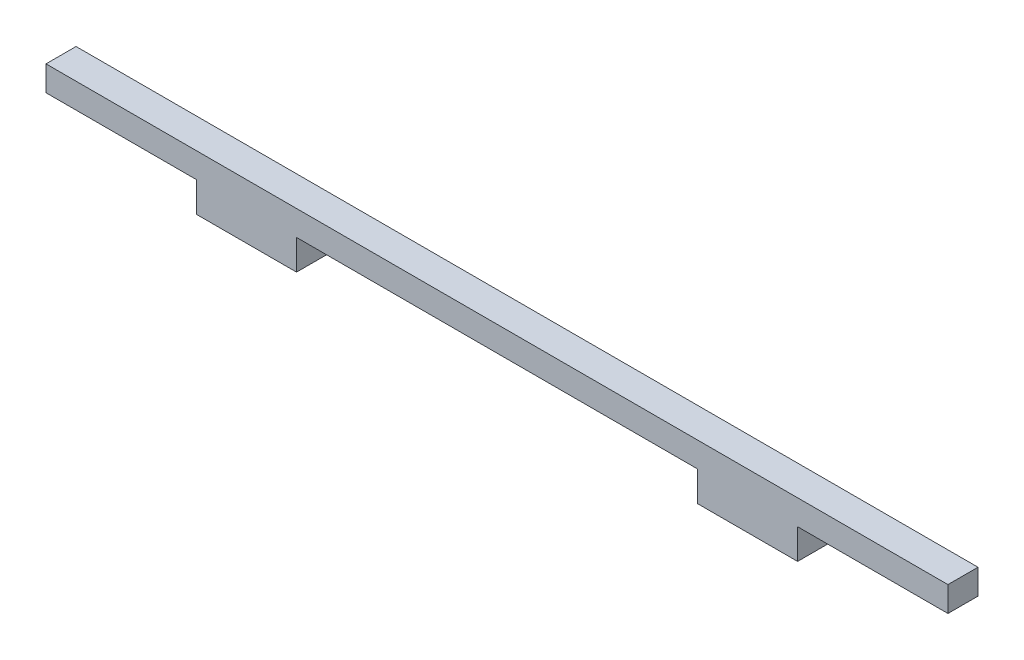
ISO-10303-21;
HEADER;
FILE_DESCRIPTION(('STEP AP214'),'2;1');
FILE_NAME('part.step','',(''),(''),'','','');
FILE_SCHEMA(('AUTOMOTIVE_DESIGN { 1 0 10303 214 1 1 1 1 }'));
ENDSEC;
DATA;
#1=APPLICATION_CONTEXT('core data for automotive mechanical design processes');
#2=APPLICATION_PROTOCOL_DEFINITION('international standard','automotive_design',2000,#1);
#3=PRODUCT_CONTEXT('',#1,'mechanical');
#4=PRODUCT('Part','Part','',(#3));
#5=PRODUCT_RELATED_PRODUCT_CATEGORY('part','',(#4));
#6=PRODUCT_DEFINITION_FORMATION('','',#4);
#7=PRODUCT_DEFINITION_CONTEXT('part definition',#1,'design');
#8=PRODUCT_DEFINITION('design','',#6,#7);
#9=PRODUCT_DEFINITION_SHAPE('','',#8);
#10=(LENGTH_UNIT() NAMED_UNIT(*) SI_UNIT(.MILLI.,.METRE.));
#11=(NAMED_UNIT(*) PLANE_ANGLE_UNIT() SI_UNIT($,.RADIAN.));
#12=(NAMED_UNIT(*) SI_UNIT($,.STERADIAN.) SOLID_ANGLE_UNIT());
#13=UNCERTAINTY_MEASURE_WITH_UNIT(LENGTH_MEASURE(1.E-05),#10,'distance_accuracy_value','');
#14=(GEOMETRIC_REPRESENTATION_CONTEXT(3) GLOBAL_UNCERTAINTY_ASSIGNED_CONTEXT((#13)) GLOBAL_UNIT_ASSIGNED_CONTEXT((#10,
#11,#12)) REPRESENTATION_CONTEXT('',''));
#15=CARTESIAN_POINT('',(0.,0.,0.));
#16=DIRECTION('',(0.,0.,1.));
#17=DIRECTION('',(1.,0.,0.));
#18=AXIS2_PLACEMENT_3D('',#15,#16,#17);
#19=CARTESIAN_POINT('',(-45.,-2.5,3.));
#20=DIRECTION('',(1.,0.,0.));
#21=DIRECTION('',(0.,0.,-1.));
#22=AXIS2_PLACEMENT_3D('',#19,#20,#21);
#23=PLANE('',#22);
#24=DIRECTION('',(0.,-1.,0.));
#25=VECTOR('',#24,1.);
#26=CARTESIAN_POINT('',(-45.,-2.5,0.));
#27=LINE('',#26,#25);
#28=CARTESIAN_POINT('',(-45.,0.,0.));
#29=VERTEX_POINT('',#28);
#30=CARTESIAN_POINT('',(-45.,-2.5,0.));
#31=VERTEX_POINT('',#30);
#32=EDGE_CURVE('E168',#29,#31,#27,.T.);
#33=ORIENTED_EDGE('',*,*,#32,.T.);
#34=DIRECTION('',(0.,0.,-1.));
#35=VECTOR('',#34,1.);
#36=CARTESIAN_POINT('',(-45.,-2.5,3.));
#37=LINE('',#36,#35);
#38=CARTESIAN_POINT('',(-45.,-2.5,3.));
#39=VERTEX_POINT('',#38);
#40=EDGE_CURVE('E11',#39,#31,#37,.T.);
#41=ORIENTED_EDGE('',*,*,#40,.F.);
#42=DIRECTION('',(0.,-1.,0.));
#43=VECTOR('',#42,1.);
#44=CARTESIAN_POINT('',(-45.,-2.5,3.));
#45=LINE('',#44,#43);
#46=CARTESIAN_POINT('',(-45.,0.,3.));
#47=VERTEX_POINT('',#46);
#48=EDGE_CURVE('E202',#47,#39,#45,.T.);
#49=ORIENTED_EDGE('',*,*,#48,.F.);
#50=DIRECTION('',(0.,0.,-1.));
#51=VECTOR('',#50,1.);
#52=CARTESIAN_POINT('',(-45.,0.,3.));
#53=LINE('',#52,#51);
#54=EDGE_CURVE('E164',#47,#29,#53,.T.);
#55=ORIENTED_EDGE('',*,*,#54,.T.);
#56=EDGE_LOOP('',(#33,#41,#49,#55));
#57=FACE_BOUND('',#56,.T.);
#58=ADVANCED_FACE('F43',(#57),#23,.F.);
#59=CARTESIAN_POINT('',(-30.,-2.5,3.));
#60=DIRECTION('',(0.,1.,0.));
#61=DIRECTION('',(-1.,0.,0.));
#62=AXIS2_PLACEMENT_3D('',#59,#60,#61);
#63=PLANE('',#62);
#64=DIRECTION('',(1.,0.,0.));
#65=VECTOR('',#64,1.);
#66=CARTESIAN_POINT('',(-30.,-2.5,0.));
#67=LINE('',#66,#65);
#68=CARTESIAN_POINT('',(-30.,-2.5,0.));
#69=VERTEX_POINT('',#68);
#70=EDGE_CURVE('E172',#31,#69,#67,.T.);
#71=ORIENTED_EDGE('',*,*,#70,.T.);
#72=DIRECTION('',(0.,0.,-1.));
#73=VECTOR('',#72,1.);
#74=CARTESIAN_POINT('',(-30.,-2.5,3.));
#75=LINE('',#74,#73);
#76=CARTESIAN_POINT('',(-30.,-2.5,3.));
#77=VERTEX_POINT('',#76);
#78=EDGE_CURVE('E52',#77,#69,#75,.T.);
#79=ORIENTED_EDGE('',*,*,#78,.F.);
#80=DIRECTION('',(1.,0.,0.));
#81=VECTOR('',#80,1.);
#82=CARTESIAN_POINT('',(-30.,-2.5,3.));
#83=LINE('',#82,#81);
#84=EDGE_CURVE('E115',#39,#77,#83,.T.);
#85=ORIENTED_EDGE('',*,*,#84,.F.);
#86=ORIENTED_EDGE('',*,*,#40,.T.);
#87=EDGE_LOOP('',(#71,#79,#85,#86));
#88=FACE_BOUND('',#87,.T.);
#89=ADVANCED_FACE('F296',(#88),#63,.F.);
#90=CARTESIAN_POINT('',(-30.,-5.5,3.));
#91=DIRECTION('',(1.,0.,0.));
#92=DIRECTION('',(0.,0.,-1.));
#93=AXIS2_PLACEMENT_3D('',#90,#91,#92);
#94=PLANE('',#93);
#95=DIRECTION('',(0.,-1.,0.));
#96=VECTOR('',#95,1.);
#97=CARTESIAN_POINT('',(-30.,-5.5,0.));
#98=LINE('',#97,#96);
#99=CARTESIAN_POINT('',(-30.,-5.5,0.));
#100=VERTEX_POINT('',#99);
#101=EDGE_CURVE('E175',#69,#100,#98,.T.);
#102=ORIENTED_EDGE('',*,*,#101,.T.);
#103=DIRECTION('',(0.,0.,-1.));
#104=VECTOR('',#103,1.);
#105=CARTESIAN_POINT('',(-30.,-5.5,3.));
#106=LINE('',#105,#104);
#107=CARTESIAN_POINT('',(-30.,-5.5,3.));
#108=VERTEX_POINT('',#107);
#109=EDGE_CURVE('E229',#108,#100,#106,.T.);
#110=ORIENTED_EDGE('',*,*,#109,.F.);
#111=DIRECTION('',(0.,-1.,0.));
#112=VECTOR('',#111,1.);
#113=CARTESIAN_POINT('',(-30.,-5.5,3.));
#114=LINE('',#113,#112);
#115=EDGE_CURVE('E239',#77,#108,#114,.T.);
#116=ORIENTED_EDGE('',*,*,#115,.F.);
#117=ORIENTED_EDGE('',*,*,#78,.T.);
#118=EDGE_LOOP('',(#102,#110,#116,#117));
#119=FACE_BOUND('',#118,.T.);
#120=ADVANCED_FACE('F237',(#119),#94,.F.);
#121=CARTESIAN_POINT('',(-20.,-5.5,3.));
#122=DIRECTION('',(0.,1.,0.));
#123=DIRECTION('',(-1.,0.,0.));
#124=AXIS2_PLACEMENT_3D('',#121,#122,#123);
#125=PLANE('',#124);
#126=DIRECTION('',(1.,0.,0.));
#127=VECTOR('',#126,1.);
#128=CARTESIAN_POINT('',(-20.,-5.5,0.));
#129=LINE('',#128,#127);
#130=CARTESIAN_POINT('',(-20.,-5.5,0.));
#131=VERTEX_POINT('',#130);
#132=EDGE_CURVE('E178',#100,#131,#129,.T.);
#133=ORIENTED_EDGE('',*,*,#132,.T.);
#134=DIRECTION('',(0.,0.,-1.));
#135=VECTOR('',#134,1.);
#136=CARTESIAN_POINT('',(-20.,-5.5,3.));
#137=LINE('',#136,#135);
#138=CARTESIAN_POINT('',(-20.,-5.5,3.));
#139=VERTEX_POINT('',#138);
#140=EDGE_CURVE('E225',#139,#131,#137,.T.);
#141=ORIENTED_EDGE('',*,*,#140,.F.);
#142=DIRECTION('',(1.,0.,0.));
#143=VECTOR('',#142,1.);
#144=CARTESIAN_POINT('',(-20.,-5.5,3.));
#145=LINE('',#144,#143);
#146=EDGE_CURVE('E258',#108,#139,#145,.T.);
#147=ORIENTED_EDGE('',*,*,#146,.F.);
#148=ORIENTED_EDGE('',*,*,#109,.T.);
#149=EDGE_LOOP('',(#133,#141,#147,#148));
#150=FACE_BOUND('',#149,.T.);
#151=ADVANCED_FACE('F248',(#150),#125,.F.);
#152=CARTESIAN_POINT('',(-20.,-2.5,3.));
#153=DIRECTION('',(-1.,0.,0.));
#154=DIRECTION('',(0.,0.,1.));
#155=AXIS2_PLACEMENT_3D('',#152,#153,#154);
#156=PLANE('',#155);
#157=DIRECTION('',(0.,1.,0.));
#158=VECTOR('',#157,1.);
#159=CARTESIAN_POINT('',(-20.,-2.5,0.));
#160=LINE('',#159,#158);
#161=CARTESIAN_POINT('',(-20.,-2.5,0.));
#162=VERTEX_POINT('',#161);
#163=EDGE_CURVE('E181',#131,#162,#160,.T.);
#164=ORIENTED_EDGE('',*,*,#163,.T.);
#165=DIRECTION('',(0.,0.,-1.));
#166=VECTOR('',#165,1.);
#167=CARTESIAN_POINT('',(-20.,-2.5,3.));
#168=LINE('',#167,#166);
#169=CARTESIAN_POINT('',(-20.,-2.5,3.));
#170=VERTEX_POINT('',#169);
#171=EDGE_CURVE('E221',#170,#162,#168,.T.);
#172=ORIENTED_EDGE('',*,*,#171,.F.);
#173=DIRECTION('',(0.,1.,0.));
#174=VECTOR('',#173,1.);
#175=CARTESIAN_POINT('',(-20.,-2.5,3.));
#176=LINE('',#175,#174);
#177=EDGE_CURVE('E254',#139,#170,#176,.T.);
#178=ORIENTED_EDGE('',*,*,#177,.F.);
#179=ORIENTED_EDGE('',*,*,#140,.T.);
#180=EDGE_LOOP('',(#164,#172,#178,#179));
#181=FACE_BOUND('',#180,.T.);
#182=ADVANCED_FACE('F252',(#181),#156,.F.);
#183=CARTESIAN_POINT('',(20.,-2.49999999999999,3.));
#184=DIRECTION('',(0.,1.,0.));
#185=DIRECTION('',(-1.,0.,0.));
#186=AXIS2_PLACEMENT_3D('',#183,#184,#185);
#187=PLANE('',#186);
#188=DIRECTION('',(1.,0.,0.));
#189=VECTOR('',#188,1.);
#190=CARTESIAN_POINT('',(20.,-2.49999999999999,0.));
#191=LINE('',#190,#189);
#192=CARTESIAN_POINT('',(20.,-2.49999999999999,0.));
#193=VERTEX_POINT('',#192);
#194=EDGE_CURVE('E184',#162,#193,#191,.T.);
#195=ORIENTED_EDGE('',*,*,#194,.T.);
#196=DIRECTION('',(0.,0.,-1.));
#197=VECTOR('',#196,1.);
#198=CARTESIAN_POINT('',(20.,-2.49999999999999,3.));
#199=LINE('',#198,#197);
#200=CARTESIAN_POINT('',(20.,-2.49999999999999,3.));
#201=VERTEX_POINT('',#200);
#202=EDGE_CURVE('E217',#201,#193,#199,.T.);
#203=ORIENTED_EDGE('',*,*,#202,.F.);
#204=DIRECTION('',(1.,0.,0.));
#205=VECTOR('',#204,1.);
#206=CARTESIAN_POINT('',(20.,-2.49999999999999,3.));
#207=LINE('',#206,#205);
#208=EDGE_CURVE('E257',#170,#201,#207,.T.);
#209=ORIENTED_EDGE('',*,*,#208,.F.);
#210=ORIENTED_EDGE('',*,*,#171,.T.);
#211=EDGE_LOOP('',(#195,#203,#209,#210));
#212=FACE_BOUND('',#211,.T.);
#213=ADVANCED_FACE('F309',(#212),#187,.F.);
#214=CARTESIAN_POINT('',(20.,-5.5,3.));
#215=DIRECTION('',(1.,0.,0.));
#216=DIRECTION('',(0.,0.,-1.));
#217=AXIS2_PLACEMENT_3D('',#214,#215,#216);
#218=PLANE('',#217);
#219=DIRECTION('',(0.,-1.,0.));
#220=VECTOR('',#219,1.);
#221=CARTESIAN_POINT('',(20.,-5.5,0.));
#222=LINE('',#221,#220);
#223=CARTESIAN_POINT('',(20.,-5.5,0.));
#224=VERTEX_POINT('',#223);
#225=EDGE_CURVE('E187',#193,#224,#222,.T.);
#226=ORIENTED_EDGE('',*,*,#225,.T.);
#227=DIRECTION('',(0.,0.,-1.));
#228=VECTOR('',#227,1.);
#229=CARTESIAN_POINT('',(20.,-5.5,3.));
#230=LINE('',#229,#228);
#231=CARTESIAN_POINT('',(20.,-5.5,3.));
#232=VERTEX_POINT('',#231);
#233=EDGE_CURVE('E213',#232,#224,#230,.T.);
#234=ORIENTED_EDGE('',*,*,#233,.F.);
#235=DIRECTION('',(0.,-1.,0.));
#236=VECTOR('',#235,1.);
#237=CARTESIAN_POINT('',(20.,-5.5,3.));
#238=LINE('',#237,#236);
#239=EDGE_CURVE('E262',#201,#232,#238,.T.);
#240=ORIENTED_EDGE('',*,*,#239,.F.);
#241=ORIENTED_EDGE('',*,*,#202,.T.);
#242=EDGE_LOOP('',(#226,#234,#240,#241));
#243=FACE_BOUND('',#242,.T.);
#244=ADVANCED_FACE('F312',(#243),#218,.F.);
#245=CARTESIAN_POINT('',(30.,-5.5,3.));
#246=DIRECTION('',(0.,1.,0.));
#247=DIRECTION('',(-1.,0.,0.));
#248=AXIS2_PLACEMENT_3D('',#245,#246,#247);
#249=PLANE('',#248);
#250=DIRECTION('',(1.,0.,0.));
#251=VECTOR('',#250,1.);
#252=CARTESIAN_POINT('',(30.,-5.5,0.));
#253=LINE('',#252,#251);
#254=CARTESIAN_POINT('',(30.,-5.5,0.));
#255=VERTEX_POINT('',#254);
#256=EDGE_CURVE('E190',#224,#255,#253,.T.);
#257=ORIENTED_EDGE('',*,*,#256,.T.);
#258=DIRECTION('',(0.,0.,-1.));
#259=VECTOR('',#258,1.);
#260=CARTESIAN_POINT('',(30.,-5.5,3.));
#261=LINE('',#260,#259);
#262=CARTESIAN_POINT('',(30.,-5.5,3.));
#263=VERTEX_POINT('',#262);
#264=EDGE_CURVE('E209',#263,#255,#261,.T.);
#265=ORIENTED_EDGE('',*,*,#264,.F.);
#266=DIRECTION('',(1.,0.,0.));
#267=VECTOR('',#266,1.);
#268=CARTESIAN_POINT('',(30.,-5.5,3.));
#269=LINE('',#268,#267);
#270=EDGE_CURVE('E269',#232,#263,#269,.T.);
#271=ORIENTED_EDGE('',*,*,#270,.F.);
#272=ORIENTED_EDGE('',*,*,#233,.T.);
#273=EDGE_LOOP('',(#257,#265,#271,#272));
#274=FACE_BOUND('',#273,.T.);
#275=ADVANCED_FACE('F277',(#274),#249,.F.);
#276=CARTESIAN_POINT('',(30.,-2.5,3.));
#277=DIRECTION('',(-1.,0.,0.));
#278=DIRECTION('',(0.,0.,1.));
#279=AXIS2_PLACEMENT_3D('',#276,#277,#278);
#280=PLANE('',#279);
#281=DIRECTION('',(0.,1.,0.));
#282=VECTOR('',#281,1.);
#283=CARTESIAN_POINT('',(30.,-2.5,0.));
#284=LINE('',#283,#282);
#285=CARTESIAN_POINT('',(30.,-2.5,0.));
#286=VERTEX_POINT('',#285);
#287=EDGE_CURVE('E193',#255,#286,#284,.T.);
#288=ORIENTED_EDGE('',*,*,#287,.T.);
#289=DIRECTION('',(0.,0.,-1.));
#290=VECTOR('',#289,1.);
#291=CARTESIAN_POINT('',(30.,-2.5,3.));
#292=LINE('',#291,#290);
#293=CARTESIAN_POINT('',(30.,-2.5,3.));
#294=VERTEX_POINT('',#293);
#295=EDGE_CURVE('E157',#294,#286,#292,.T.);
#296=ORIENTED_EDGE('',*,*,#295,.F.);
#297=DIRECTION('',(0.,1.,0.));
#298=VECTOR('',#297,1.);
#299=CARTESIAN_POINT('',(30.,-2.5,3.));
#300=LINE('',#299,#298);
#301=EDGE_CURVE('E146',#263,#294,#300,.T.);
#302=ORIENTED_EDGE('',*,*,#301,.F.);
#303=ORIENTED_EDGE('',*,*,#264,.T.);
#304=EDGE_LOOP('',(#288,#296,#302,#303));
#305=FACE_BOUND('',#304,.T.);
#306=ADVANCED_FACE('F281',(#305),#280,.F.);
#307=CARTESIAN_POINT('',(45.,-2.5,3.));
#308=DIRECTION('',(0.,1.,0.));
#309=DIRECTION('',(-1.,0.,0.));
#310=AXIS2_PLACEMENT_3D('',#307,#308,#309);
#311=PLANE('',#310);
#312=DIRECTION('',(1.,0.,0.));
#313=VECTOR('',#312,1.);
#314=CARTESIAN_POINT('',(45.,-2.5,0.));
#315=LINE('',#314,#313);
#316=CARTESIAN_POINT('',(45.,-2.5,0.));
#317=VERTEX_POINT('',#316);
#318=EDGE_CURVE('E155',#286,#317,#315,.T.);
#319=ORIENTED_EDGE('',*,*,#318,.T.);
#320=DIRECTION('',(0.,0.,-1.));
#321=VECTOR('',#320,1.);
#322=CARTESIAN_POINT('',(45.,-2.5,3.));
#323=LINE('',#322,#321);
#324=CARTESIAN_POINT('',(45.,-2.5,3.));
#325=VERTEX_POINT('',#324);
#326=EDGE_CURVE('E152',#325,#317,#323,.T.);
#327=ORIENTED_EDGE('',*,*,#326,.F.);
#328=DIRECTION('',(1.,0.,0.));
#329=VECTOR('',#328,1.);
#330=CARTESIAN_POINT('',(45.,-2.5,3.));
#331=LINE('',#330,#329);
#332=EDGE_CURVE('E140',#294,#325,#331,.T.);
#333=ORIENTED_EDGE('',*,*,#332,.F.);
#334=ORIENTED_EDGE('',*,*,#295,.T.);
#335=EDGE_LOOP('',(#319,#327,#333,#334));
#336=FACE_BOUND('',#335,.T.);
#337=ADVANCED_FACE('F153',(#336),#311,.F.);
#338=CARTESIAN_POINT('',(45.,0.,3.));
#339=DIRECTION('',(-1.,0.,0.));
#340=DIRECTION('',(0.,0.,1.));
#341=AXIS2_PLACEMENT_3D('',#338,#339,#340);
#342=PLANE('',#341);
#343=DIRECTION('',(0.,1.,0.));
#344=VECTOR('',#343,1.);
#345=CARTESIAN_POINT('',(45.,0.,0.));
#346=LINE('',#345,#344);
#347=CARTESIAN_POINT('',(45.,0.,0.));
#348=VERTEX_POINT('',#347);
#349=EDGE_CURVE('E101',#317,#348,#346,.T.);
#350=ORIENTED_EDGE('',*,*,#349,.T.);
#351=DIRECTION('',(0.,0.,-1.));
#352=VECTOR('',#351,1.);
#353=CARTESIAN_POINT('',(45.,0.,3.));
#354=LINE('',#353,#352);
#355=CARTESIAN_POINT('',(45.,0.,3.));
#356=VERTEX_POINT('',#355);
#357=EDGE_CURVE('E158',#356,#348,#354,.T.);
#358=ORIENTED_EDGE('',*,*,#357,.F.);
#359=DIRECTION('',(0.,1.,0.));
#360=VECTOR('',#359,1.);
#361=CARTESIAN_POINT('',(45.,0.,3.));
#362=LINE('',#361,#360);
#363=EDGE_CURVE('E144',#325,#356,#362,.T.);
#364=ORIENTED_EDGE('',*,*,#363,.F.);
#365=ORIENTED_EDGE('',*,*,#326,.T.);
#366=EDGE_LOOP('',(#350,#358,#364,#365));
#367=FACE_BOUND('',#366,.T.);
#368=ADVANCED_FACE('F160',(#367),#342,.F.);
#369=CARTESIAN_POINT('',(-45.,0.,3.));
#370=DIRECTION('',(0.,-1.,0.));
#371=DIRECTION('',(0.,0.,-1.));
#372=AXIS2_PLACEMENT_3D('',#369,#370,#371);
#373=PLANE('',#372);
#374=DIRECTION('',(-1.,0.,0.));
#375=VECTOR('',#374,1.);
#376=CARTESIAN_POINT('',(-45.,0.,0.));
#377=LINE('',#376,#375);
#378=EDGE_CURVE('E107',#348,#29,#377,.T.);
#379=ORIENTED_EDGE('',*,*,#378,.T.);
#380=ORIENTED_EDGE('',*,*,#54,.F.);
#381=DIRECTION('',(-1.,0.,0.));
#382=VECTOR('',#381,1.);
#383=CARTESIAN_POINT('',(-45.,0.,3.));
#384=LINE('',#383,#382);
#385=EDGE_CURVE('E60',#356,#47,#384,.T.);
#386=ORIENTED_EDGE('',*,*,#385,.F.);
#387=ORIENTED_EDGE('',*,*,#357,.T.);
#388=EDGE_LOOP('',(#379,#380,#386,#387));
#389=FACE_BOUND('',#388,.T.);
#390=ADVANCED_FACE('F285',(#389),#373,.F.);
#391=CARTESIAN_POINT('',(0.,0.,3.));
#392=DIRECTION('',(0.,0.,-1.));
#393=DIRECTION('',(-1.,0.,0.));
#394=AXIS2_PLACEMENT_3D('',#391,#392,#393);
#395=PLANE('',#394);
#396=ORIENTED_EDGE('',*,*,#48,.T.);
#397=ORIENTED_EDGE('',*,*,#84,.T.);
#398=ORIENTED_EDGE('',*,*,#115,.T.);
#399=ORIENTED_EDGE('',*,*,#146,.T.);
#400=ORIENTED_EDGE('',*,*,#177,.T.);
#401=ORIENTED_EDGE('',*,*,#208,.T.);
#402=ORIENTED_EDGE('',*,*,#239,.T.);
#403=ORIENTED_EDGE('',*,*,#270,.T.);
#404=ORIENTED_EDGE('',*,*,#301,.T.);
#405=ORIENTED_EDGE('',*,*,#332,.T.);
#406=ORIENTED_EDGE('',*,*,#363,.T.);
#407=ORIENTED_EDGE('',*,*,#385,.T.);
#408=EDGE_LOOP('',(#396,#397,#398,#399,#400,#401,#402,#403,#404,#405,#406,#407));
#409=FACE_BOUND('',#408,.T.);
#410=ADVANCED_FACE('F142',(#409),#395,.F.);
#411=CARTESIAN_POINT('',(0.,0.,0.));
#412=DIRECTION('',(0.,0.,-1.));
#413=DIRECTION('',(-1.,0.,0.));
#414=AXIS2_PLACEMENT_3D('',#411,#412,#413);
#415=PLANE('',#414);
#416=ORIENTED_EDGE('',*,*,#32,.F.);
#417=ORIENTED_EDGE('',*,*,#378,.F.);
#418=ORIENTED_EDGE('',*,*,#349,.F.);
#419=ORIENTED_EDGE('',*,*,#318,.F.);
#420=ORIENTED_EDGE('',*,*,#287,.F.);
#421=ORIENTED_EDGE('',*,*,#256,.F.);
#422=ORIENTED_EDGE('',*,*,#225,.F.);
#423=ORIENTED_EDGE('',*,*,#194,.F.);
#424=ORIENTED_EDGE('',*,*,#163,.F.);
#425=ORIENTED_EDGE('',*,*,#132,.F.);
#426=ORIENTED_EDGE('',*,*,#101,.F.);
#427=ORIENTED_EDGE('',*,*,#70,.F.);
#428=EDGE_LOOP('',(#416,#417,#418,#419,#420,#421,#422,#423,#424,#425,#426,#427));
#429=FACE_BOUND('',#428,.T.);
#430=ADVANCED_FACE('F243',(#429),#415,.T.);
#431=CLOSED_SHELL('',(#58,#89,#120,#151,#182,#213,#244,#275,#306,#337,#368,#390,#410,#430));
#432=MANIFOLD_SOLID_BREP('B2',#431);
#433=ADVANCED_BREP_SHAPE_REPRESENTATION('',(#18,#432),#14);
#434=SHAPE_DEFINITION_REPRESENTATION(#9,#433);
ENDSEC;
END-ISO-10303-21;
